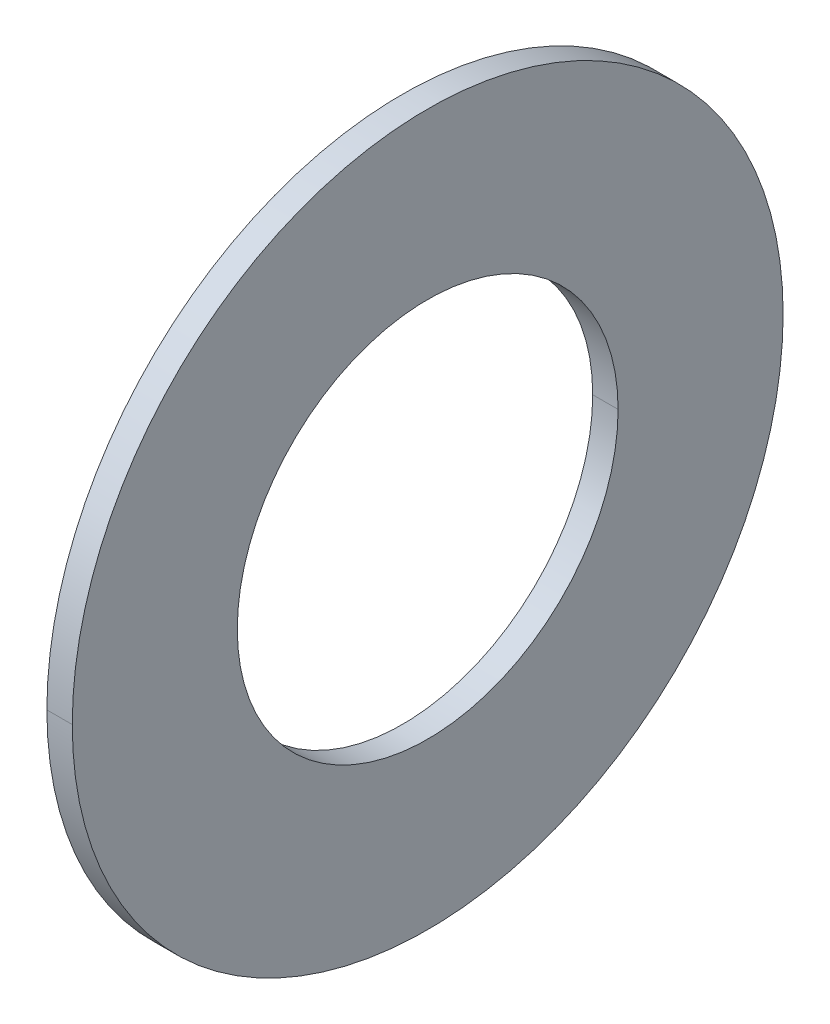
ISO-10303-21;
HEADER;
FILE_DESCRIPTION(('STEP AP214'),'2;1');
FILE_NAME('part.step','',(''),(''),'','','');
FILE_SCHEMA(('AUTOMOTIVE_DESIGN { 1 0 10303 214 1 1 1 1 }'));
ENDSEC;
DATA;
#1=APPLICATION_CONTEXT('core data for automotive mechanical design processes');
#2=APPLICATION_PROTOCOL_DEFINITION('international standard','automotive_design',2000,#1);
#3=PRODUCT_CONTEXT('',#1,'mechanical');
#4=PRODUCT('Part','Part','',(#3));
#5=PRODUCT_RELATED_PRODUCT_CATEGORY('part','',(#4));
#6=PRODUCT_DEFINITION_FORMATION('','',#4);
#7=PRODUCT_DEFINITION_CONTEXT('part definition',#1,'design');
#8=PRODUCT_DEFINITION('design','',#6,#7);
#9=PRODUCT_DEFINITION_SHAPE('','',#8);
#10=(LENGTH_UNIT() NAMED_UNIT(*) SI_UNIT(.MILLI.,.METRE.));
#11=(NAMED_UNIT(*) PLANE_ANGLE_UNIT() SI_UNIT($,.RADIAN.));
#12=(NAMED_UNIT(*) SI_UNIT($,.STERADIAN.) SOLID_ANGLE_UNIT());
#13=UNCERTAINTY_MEASURE_WITH_UNIT(LENGTH_MEASURE(1.E-05),#10,'distance_accuracy_value','');
#14=(GEOMETRIC_REPRESENTATION_CONTEXT(3) GLOBAL_UNCERTAINTY_ASSIGNED_CONTEXT((#13)) GLOBAL_UNIT_ASSIGNED_CONTEXT((#10,
#11,#12)) REPRESENTATION_CONTEXT('',''));
#15=CARTESIAN_POINT('',(0.,0.,0.));
#16=DIRECTION('',(0.,0.,1.));
#17=DIRECTION('',(1.,0.,0.));
#18=AXIS2_PLACEMENT_3D('',#15,#16,#17);
#19=CARTESIAN_POINT('',(-2.,14.,0.));
#20=DIRECTION('',(-1.,0.,0.));
#21=DIRECTION('',(0.,0.,1.));
#22=AXIS2_PLACEMENT_3D('',#19,#20,#21);
#23=PLANE('',#22);
#24=CARTESIAN_POINT('',(-2.,0.,0.));
#25=DIRECTION('',(1.,0.,0.));
#26=DIRECTION('',(0.,0.,-1.));
#27=AXIS2_PLACEMENT_3D('',#24,#25,#26);
#28=CIRCLE('',#27,7.5);
#29=CARTESIAN_POINT('',(-2.,0.,-7.5));
#30=VERTEX_POINT('',#29);
#31=CARTESIAN_POINT('',(-2.,0.,7.5));
#32=VERTEX_POINT('',#31);
#33=EDGE_CURVE('E11',#30,#32,#28,.T.);
#34=ORIENTED_EDGE('',*,*,#33,.T.);
#35=CARTESIAN_POINT('',(-2.,0.,0.));
#36=DIRECTION('',(1.,0.,0.));
#37=DIRECTION('',(0.,0.,-1.));
#38=AXIS2_PLACEMENT_3D('',#35,#36,#37);
#39=CIRCLE('',#38,7.5);
#40=EDGE_CURVE('E24',#32,#30,#39,.T.);
#41=ORIENTED_EDGE('',*,*,#40,.T.);
#42=EDGE_LOOP('',(#34,#41));
#43=FACE_BOUND('',#42,.T.);
#44=CARTESIAN_POINT('',(-2.,0.,0.));
#45=DIRECTION('',(1.,0.,0.));
#46=DIRECTION('',(0.,0.,-1.));
#47=AXIS2_PLACEMENT_3D('',#44,#45,#46);
#48=CIRCLE('',#47,14.);
#49=CARTESIAN_POINT('',(-2.,0.,14.));
#50=VERTEX_POINT('',#49);
#51=CARTESIAN_POINT('',(-2.,0.,-14.));
#52=VERTEX_POINT('',#51);
#53=EDGE_CURVE('E94',#50,#52,#48,.T.);
#54=ORIENTED_EDGE('',*,*,#53,.F.);
#55=CARTESIAN_POINT('',(-2.,0.,0.));
#56=DIRECTION('',(1.,0.,0.));
#57=DIRECTION('',(0.,0.,-1.));
#58=AXIS2_PLACEMENT_3D('',#55,#56,#57);
#59=CIRCLE('',#58,14.);
#60=EDGE_CURVE('E89',#52,#50,#59,.T.);
#61=ORIENTED_EDGE('',*,*,#60,.F.);
#62=EDGE_LOOP('',(#54,#61));
#63=FACE_BOUND('',#62,.T.);
#64=ADVANCED_FACE('F16',(#43,#63),#23,.T.);
#65=CARTESIAN_POINT('',(50.,0.,0.));
#66=DIRECTION('',(1.,0.,0.));
#67=DIRECTION('',(0.,-1.,0.));
#68=AXIS2_PLACEMENT_3D('',#65,#66,#67);
#69=CYLINDRICAL_SURFACE('',#68,14.);
#70=DIRECTION('',(1.,0.,0.));
#71=VECTOR('',#70,1.);
#72=CARTESIAN_POINT('',(-2.,0.,14.));
#73=LINE('',#72,#71);
#74=CARTESIAN_POINT('',(-1.,0.,14.));
#75=VERTEX_POINT('',#74);
#76=EDGE_CURVE('E85',#50,#75,#73,.T.);
#77=ORIENTED_EDGE('',*,*,#76,.T.);
#78=CARTESIAN_POINT('',(-1.,0.,0.));
#79=DIRECTION('',(1.,0.,0.));
#80=DIRECTION('',(0.,0.,-1.));
#81=AXIS2_PLACEMENT_3D('',#78,#79,#80);
#82=CIRCLE('',#81,14.);
#83=CARTESIAN_POINT('',(-1.,0.,-14.));
#84=VERTEX_POINT('',#83);
#85=EDGE_CURVE('E80',#84,#75,#82,.T.);
#86=ORIENTED_EDGE('',*,*,#85,.F.);
#87=DIRECTION('',(1.,0.,0.));
#88=VECTOR('',#87,1.);
#89=CARTESIAN_POINT('',(-2.,0.,-14.));
#90=LINE('',#89,#88);
#91=EDGE_CURVE('E69',#52,#84,#90,.T.);
#92=ORIENTED_EDGE('',*,*,#91,.F.);
#93=ORIENTED_EDGE('',*,*,#60,.T.);
#94=EDGE_LOOP('',(#77,#86,#92,#93));
#95=FACE_BOUND('',#94,.T.);
#96=ADVANCED_FACE('F110',(#95),#69,.T.);
#97=CARTESIAN_POINT('',(50.,0.,0.));
#98=DIRECTION('',(1.,0.,0.));
#99=DIRECTION('',(0.,1.,0.));
#100=AXIS2_PLACEMENT_3D('',#97,#98,#99);
#101=CYLINDRICAL_SURFACE('',#100,14.);
#102=ORIENTED_EDGE('',*,*,#76,.F.);
#103=ORIENTED_EDGE('',*,*,#53,.T.);
#104=ORIENTED_EDGE('',*,*,#91,.T.);
#105=CARTESIAN_POINT('',(-1.,0.,0.));
#106=DIRECTION('',(1.,0.,0.));
#107=DIRECTION('',(0.,0.,-1.));
#108=AXIS2_PLACEMENT_3D('',#105,#106,#107);
#109=CIRCLE('',#108,14.);
#110=EDGE_CURVE('E66',#75,#84,#109,.T.);
#111=ORIENTED_EDGE('',*,*,#110,.F.);
#112=EDGE_LOOP('',(#102,#103,#104,#111));
#113=FACE_BOUND('',#112,.T.);
#114=ADVANCED_FACE('F105',(#113),#101,.T.);
#115=CARTESIAN_POINT('',(-1.,7.5,0.));
#116=DIRECTION('',(1.,0.,0.));
#117=DIRECTION('',(0.,0.,-1.));
#118=AXIS2_PLACEMENT_3D('',#115,#116,#117);
#119=PLANE('',#118);
#120=ORIENTED_EDGE('',*,*,#85,.T.);
#121=ORIENTED_EDGE('',*,*,#110,.T.);
#122=EDGE_LOOP('',(#120,#121));
#123=FACE_BOUND('',#122,.T.);
#124=CARTESIAN_POINT('',(-1.,0.,0.));
#125=DIRECTION('',(1.,0.,0.));
#126=DIRECTION('',(0.,0.,-1.));
#127=AXIS2_PLACEMENT_3D('',#124,#125,#126);
#128=CIRCLE('',#127,7.5);
#129=CARTESIAN_POINT('',(-1.,0.,7.5));
#130=VERTEX_POINT('',#129);
#131=CARTESIAN_POINT('',(-1.,0.,-7.5));
#132=VERTEX_POINT('',#131);
#133=EDGE_CURVE('E54',#130,#132,#128,.T.);
#134=ORIENTED_EDGE('',*,*,#133,.F.);
#135=CARTESIAN_POINT('',(-1.,0.,0.));
#136=DIRECTION('',(1.,0.,0.));
#137=DIRECTION('',(0.,0.,-1.));
#138=AXIS2_PLACEMENT_3D('',#135,#136,#137);
#139=CIRCLE('',#138,7.5);
#140=EDGE_CURVE('E50',#132,#130,#139,.T.);
#141=ORIENTED_EDGE('',*,*,#140,.F.);
#142=EDGE_LOOP('',(#134,#141));
#143=FACE_BOUND('',#142,.T.);
#144=ADVANCED_FACE('F52',(#123,#143),#119,.T.);
#145=CARTESIAN_POINT('',(50.,0.,0.));
#146=DIRECTION('',(1.,0.,0.));
#147=DIRECTION('',(0.,-1.,0.));
#148=AXIS2_PLACEMENT_3D('',#145,#146,#147);
#149=CYLINDRICAL_SURFACE('',#148,7.5);
#150=DIRECTION('',(1.,0.,0.));
#151=VECTOR('',#150,1.);
#152=CARTESIAN_POINT('',(-2.,0.,7.5));
#153=LINE('',#152,#151);
#154=EDGE_CURVE('E58',#32,#130,#153,.T.);
#155=ORIENTED_EDGE('',*,*,#154,.F.);
#156=ORIENTED_EDGE('',*,*,#33,.F.);
#157=DIRECTION('',(1.,0.,0.));
#158=VECTOR('',#157,1.);
#159=CARTESIAN_POINT('',(-2.,0.,-7.5));
#160=LINE('',#159,#158);
#161=EDGE_CURVE('E61',#30,#132,#160,.T.);
#162=ORIENTED_EDGE('',*,*,#161,.T.);
#163=ORIENTED_EDGE('',*,*,#140,.T.);
#164=EDGE_LOOP('',(#155,#156,#162,#163));
#165=FACE_BOUND('',#164,.T.);
#166=ADVANCED_FACE('F62',(#165),#149,.F.);
#167=CARTESIAN_POINT('',(50.,0.,0.));
#168=DIRECTION('',(1.,0.,0.));
#169=DIRECTION('',(0.,1.,0.));
#170=AXIS2_PLACEMENT_3D('',#167,#168,#169);
#171=CYLINDRICAL_SURFACE('',#170,7.5);
#172=ORIENTED_EDGE('',*,*,#154,.T.);
#173=ORIENTED_EDGE('',*,*,#133,.T.);
#174=ORIENTED_EDGE('',*,*,#161,.F.);
#175=ORIENTED_EDGE('',*,*,#40,.F.);
#176=EDGE_LOOP('',(#172,#173,#174,#175));
#177=FACE_BOUND('',#176,.T.);
#178=ADVANCED_FACE('F65',(#177),#171,.F.);
#179=CLOSED_SHELL('',(#64,#96,#114,#144,#166,#178));
#180=MANIFOLD_SOLID_BREP('B1',#179);
#181=ADVANCED_BREP_SHAPE_REPRESENTATION('',(#18,#180),#14);
#182=SHAPE_DEFINITION_REPRESENTATION(#9,#181);
ENDSEC;
END-ISO-10303-21;
